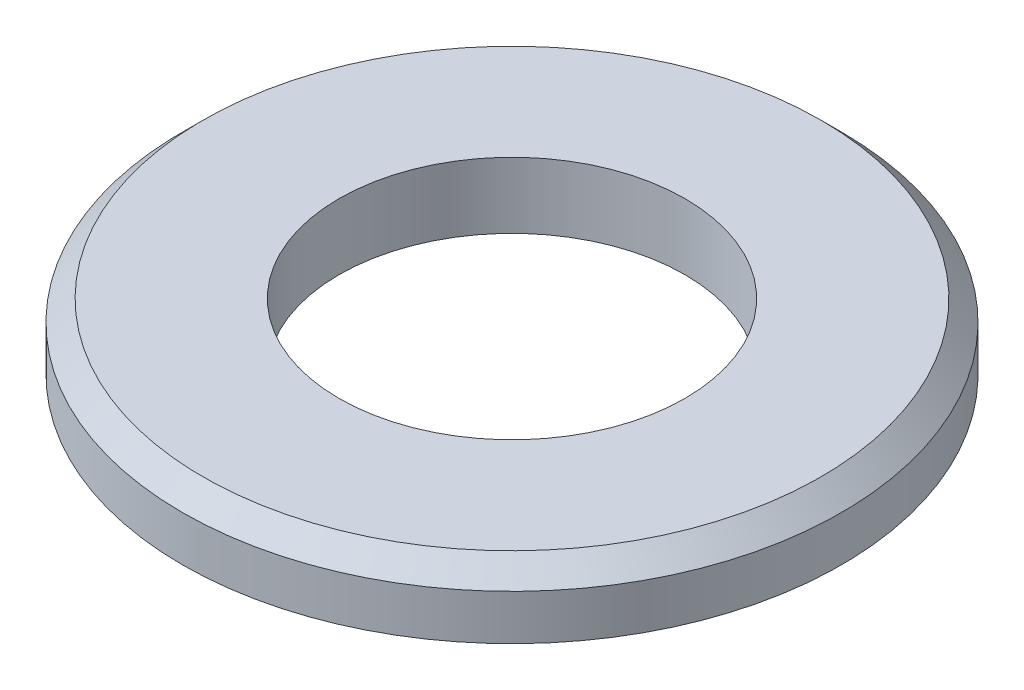
ISO-10303-21;
HEADER;
FILE_DESCRIPTION(('STEP AP214'),'2;1');
FILE_NAME('part.step','',(''),(''),'','','');
FILE_SCHEMA(('AUTOMOTIVE_DESIGN { 1 0 10303 214 1 1 1 1 }'));
ENDSEC;
DATA;
#1=APPLICATION_CONTEXT('core data for automotive mechanical design processes');
#2=APPLICATION_PROTOCOL_DEFINITION('international standard','automotive_design',2000,#1);
#3=PRODUCT_CONTEXT('',#1,'mechanical');
#4=PRODUCT('Part','Part','',(#3));
#5=PRODUCT_RELATED_PRODUCT_CATEGORY('part','',(#4));
#6=PRODUCT_DEFINITION_FORMATION('','',#4);
#7=PRODUCT_DEFINITION_CONTEXT('part definition',#1,'design');
#8=PRODUCT_DEFINITION('design','',#6,#7);
#9=PRODUCT_DEFINITION_SHAPE('','',#8);
#10=(LENGTH_UNIT() NAMED_UNIT(*) SI_UNIT(.MILLI.,.METRE.));
#11=(NAMED_UNIT(*) PLANE_ANGLE_UNIT() SI_UNIT($,.RADIAN.));
#12=(NAMED_UNIT(*) SI_UNIT($,.STERADIAN.) SOLID_ANGLE_UNIT());
#13=UNCERTAINTY_MEASURE_WITH_UNIT(LENGTH_MEASURE(1.E-05),#10,'distance_accuracy_value','');
#14=(GEOMETRIC_REPRESENTATION_CONTEXT(3) GLOBAL_UNCERTAINTY_ASSIGNED_CONTEXT((#13)) GLOBAL_UNIT_ASSIGNED_CONTEXT((#10,
#11,#12)) REPRESENTATION_CONTEXT('',''));
#15=CARTESIAN_POINT('',(0.,0.,0.));
#16=DIRECTION('',(0.,0.,1.));
#17=DIRECTION('',(1.,0.,0.));
#18=AXIS2_PLACEMENT_3D('',#15,#16,#17);
#19=CARTESIAN_POINT('',(0.,0.,0.));
#20=DIRECTION('',(0.,-1.,0.));
#21=DIRECTION('',(0.,0.,-1.));
#22=AXIS2_PLACEMENT_3D('',#19,#20,#21);
#23=CYLINDRICAL_SURFACE('',#22,4.2);
#24=CARTESIAN_POINT('',(0.,0.,0.));
#25=DIRECTION('',(0.,-1.,0.));
#26=DIRECTION('',(0.,0.,-1.));
#27=AXIS2_PLACEMENT_3D('',#24,#25,#26);
#28=CIRCLE('',#27,4.2);
#29=CARTESIAN_POINT('',(0.,0.,-4.2));
#30=VERTEX_POINT('',#29);
#31=EDGE_CURVE('E49',#30,#30,#28,.T.);
#32=ORIENTED_EDGE('',*,*,#31,.T.);
#33=EDGE_LOOP('',(#32));
#34=FACE_BOUND('',#33,.T.);
#35=CARTESIAN_POINT('',(0.,1.6,0.));
#36=DIRECTION('',(0.,-1.,0.));
#37=DIRECTION('',(0.,0.,-1.));
#38=AXIS2_PLACEMENT_3D('',#35,#36,#37);
#39=CIRCLE('',#38,4.2);
#40=CARTESIAN_POINT('',(0.,1.6,-4.2));
#41=VERTEX_POINT('',#40);
#42=EDGE_CURVE('E10',#41,#41,#39,.T.);
#43=ORIENTED_EDGE('',*,*,#42,.F.);
#44=EDGE_LOOP('',(#43));
#45=FACE_BOUND('',#44,.T.);
#46=ADVANCED_FACE('F30',(#34,#45),#23,.F.);
#47=CARTESIAN_POINT('',(4.2,1.6,0.));
#48=DIRECTION('',(0.,1.,0.));
#49=DIRECTION('',(0.,0.,1.));
#50=AXIS2_PLACEMENT_3D('',#47,#48,#49);
#51=PLANE('',#50);
#52=ORIENTED_EDGE('',*,*,#42,.T.);
#53=EDGE_LOOP('',(#52));
#54=FACE_BOUND('',#53,.T.);
#55=CARTESIAN_POINT('',(0.,1.6,0.));
#56=DIRECTION('',(0.,-1.,0.));
#57=DIRECTION('',(0.,0.,-1.));
#58=AXIS2_PLACEMENT_3D('',#55,#56,#57);
#59=CIRCLE('',#58,7.5);
#60=CARTESIAN_POINT('',(0.,1.6,-7.5));
#61=VERTEX_POINT('',#60);
#62=EDGE_CURVE('E36',#61,#61,#59,.T.);
#63=ORIENTED_EDGE('',*,*,#62,.F.);
#64=EDGE_LOOP('',(#63));
#65=FACE_BOUND('',#64,.T.);
#66=ADVANCED_FACE('F67',(#54,#65),#51,.T.);
#67=CARTESIAN_POINT('',(0.,1.1,0.));
#68=DIRECTION('',(0.,-1.,0.));
#69=DIRECTION('',(0.,0.,-1.));
#70=AXIS2_PLACEMENT_3D('',#67,#68,#69);
#71=CONICAL_SURFACE('',#70,8.,0.785398163397447);
#72=ORIENTED_EDGE('',*,*,#62,.T.);
#73=EDGE_LOOP('',(#72));
#74=FACE_BOUND('',#73,.T.);
#75=CARTESIAN_POINT('',(0.,1.1,0.));
#76=DIRECTION('',(0.,-1.,0.));
#77=DIRECTION('',(0.,0.,-1.));
#78=AXIS2_PLACEMENT_3D('',#75,#76,#77);
#79=CIRCLE('',#78,8.);
#80=CARTESIAN_POINT('',(0.,1.1,-8.));
#81=VERTEX_POINT('',#80);
#82=EDGE_CURVE('E40',#81,#81,#79,.T.);
#83=ORIENTED_EDGE('',*,*,#82,.F.);
#84=EDGE_LOOP('',(#83));
#85=FACE_BOUND('',#84,.T.);
#86=ADVANCED_FACE('F63',(#74,#85),#71,.T.);
#87=CARTESIAN_POINT('',(0.,0.,0.));
#88=DIRECTION('',(0.,-1.,0.));
#89=DIRECTION('',(0.,0.,-1.));
#90=AXIS2_PLACEMENT_3D('',#87,#88,#89);
#91=CYLINDRICAL_SURFACE('',#90,8.);
#92=ORIENTED_EDGE('',*,*,#82,.T.);
#93=EDGE_LOOP('',(#92));
#94=FACE_BOUND('',#93,.T.);
#95=CARTESIAN_POINT('',(0.,0.,0.));
#96=DIRECTION('',(0.,-1.,0.));
#97=DIRECTION('',(0.,0.,-1.));
#98=AXIS2_PLACEMENT_3D('',#95,#96,#97);
#99=CIRCLE('',#98,8.);
#100=CARTESIAN_POINT('',(0.,0.,-8.));
#101=VERTEX_POINT('',#100);
#102=EDGE_CURVE('E44',#101,#101,#99,.T.);
#103=ORIENTED_EDGE('',*,*,#102,.F.);
#104=EDGE_LOOP('',(#103));
#105=FACE_BOUND('',#104,.T.);
#106=ADVANCED_FACE('F57',(#94,#105),#91,.T.);
#107=CARTESIAN_POINT('',(4.2,0.,0.));
#108=DIRECTION('',(0.,-1.,0.));
#109=DIRECTION('',(0.,0.,-1.));
#110=AXIS2_PLACEMENT_3D('',#107,#108,#109);
#111=PLANE('',#110);
#112=ORIENTED_EDGE('',*,*,#102,.T.);
#113=EDGE_LOOP('',(#112));
#114=FACE_BOUND('',#113,.T.);
#115=ORIENTED_EDGE('',*,*,#31,.F.);
#116=EDGE_LOOP('',(#115));
#117=FACE_BOUND('',#116,.T.);
#118=ADVANCED_FACE('F55',(#114,#117),#111,.T.);
#119=CLOSED_SHELL('',(#46,#66,#86,#106,#118));
#120=MANIFOLD_SOLID_BREP('B2',#119);
#121=ADVANCED_BREP_SHAPE_REPRESENTATION('',(#18,#120),#14);
#122=SHAPE_DEFINITION_REPRESENTATION(#9,#121);
ENDSEC;
END-ISO-10303-21;
